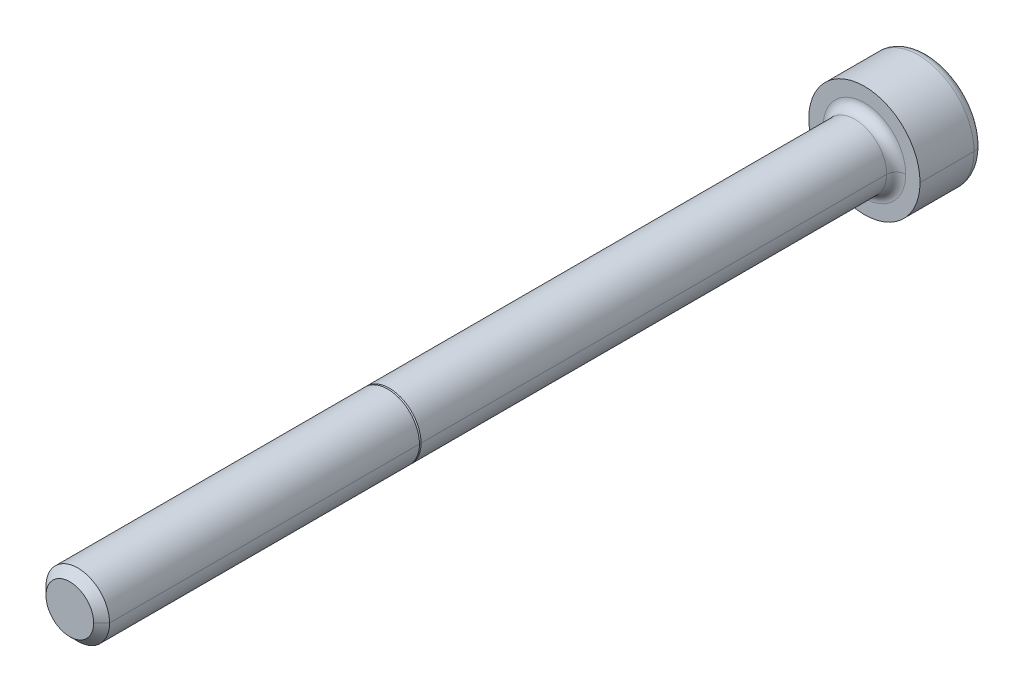
ISO-10303-21;
HEADER;
FILE_DESCRIPTION(('STEP AP214'),'2;1');
FILE_NAME('part.step','',(''),(''),'','','');
FILE_SCHEMA(('AUTOMOTIVE_DESIGN { 1 0 10303 214 1 1 1 1 }'));
ENDSEC;
DATA;
#1=APPLICATION_CONTEXT('core data for automotive mechanical design processes');
#2=APPLICATION_PROTOCOL_DEFINITION('international standard','automotive_design',2000,#1);
#3=PRODUCT_CONTEXT('',#1,'mechanical');
#4=PRODUCT('Part','Part','',(#3));
#5=PRODUCT_RELATED_PRODUCT_CATEGORY('part','',(#4));
#6=PRODUCT_DEFINITION_FORMATION('','',#4);
#7=PRODUCT_DEFINITION_CONTEXT('part definition',#1,'design');
#8=PRODUCT_DEFINITION('design','',#6,#7);
#9=PRODUCT_DEFINITION_SHAPE('','',#8);
#10=(LENGTH_UNIT() NAMED_UNIT(*) SI_UNIT(.MILLI.,.METRE.));
#11=(NAMED_UNIT(*) PLANE_ANGLE_UNIT() SI_UNIT($,.RADIAN.));
#12=(NAMED_UNIT(*) SI_UNIT($,.STERADIAN.) SOLID_ANGLE_UNIT());
#13=UNCERTAINTY_MEASURE_WITH_UNIT(LENGTH_MEASURE(1.E-05),#10,'distance_accuracy_value','');
#14=(GEOMETRIC_REPRESENTATION_CONTEXT(3) GLOBAL_UNCERTAINTY_ASSIGNED_CONTEXT((#13)) GLOBAL_UNIT_ASSIGNED_CONTEXT((#10,
#11,#12)) REPRESENTATION_CONTEXT('',''));
#15=CARTESIAN_POINT('',(0.,0.,0.));
#16=DIRECTION('',(0.,0.,1.));
#17=DIRECTION('',(1.,0.,0.));
#18=AXIS2_PLACEMENT_3D('',#15,#16,#17);
#19=CARTESIAN_POINT('',(0.,0.,-3.4));
#20=DIRECTION('',(0.,0.,1.));
#21=DIRECTION('',(1.,0.,0.));
#22=AXIS2_PLACEMENT_3D('',#19,#20,#21);
#23=TOROIDAL_SURFACE('',#22,2.9,0.6);
#24=CARTESIAN_POINT('',(-2.9,0.,-3.4));
#25=DIRECTION('',(0.,1.,0.));
#26=DIRECTION('',(-1.,0.,0.));
#27=AXIS2_PLACEMENT_3D('',#24,#25,#26);
#28=CIRCLE('',#27,0.6);
#29=CARTESIAN_POINT('',(-2.9,0.,-4.));
#30=VERTEX_POINT('',#29);
#31=CARTESIAN_POINT('',(-3.5,0.,-3.4));
#32=VERTEX_POINT('',#31);
#33=EDGE_CURVE('E183',#30,#32,#28,.T.);
#34=ORIENTED_EDGE('',*,*,#33,.F.);
#35=CARTESIAN_POINT('',(0.,0.,-4.));
#36=DIRECTION('',(0.,0.,-1.));
#37=DIRECTION('',(1.,0.,0.));
#38=AXIS2_PLACEMENT_3D('',#35,#36,#37);
#39=CIRCLE('',#38,2.9);
#40=CARTESIAN_POINT('',(2.9,0.,-4.));
#41=VERTEX_POINT('',#40);
#42=EDGE_CURVE('E170',#41,#30,#39,.T.);
#43=ORIENTED_EDGE('',*,*,#42,.F.);
#44=CARTESIAN_POINT('',(2.9,0.,-3.4));
#45=DIRECTION('',(0.,-1.,0.));
#46=DIRECTION('',(0.,0.,-1.));
#47=AXIS2_PLACEMENT_3D('',#44,#45,#46);
#48=CIRCLE('',#47,0.6);
#49=CARTESIAN_POINT('',(3.5,0.,-3.4));
#50=VERTEX_POINT('',#49);
#51=EDGE_CURVE('E192',#41,#50,#48,.T.);
#52=ORIENTED_EDGE('',*,*,#51,.T.);
#53=CARTESIAN_POINT('',(0.,0.,-3.4));
#54=DIRECTION('',(0.,0.,1.));
#55=DIRECTION('',(1.,0.,0.));
#56=AXIS2_PLACEMENT_3D('',#53,#54,#55);
#57=CIRCLE('',#56,3.5);
#58=EDGE_CURVE('E184',#32,#50,#57,.T.);
#59=ORIENTED_EDGE('',*,*,#58,.F.);
#60=EDGE_LOOP('',(#34,#43,#52,#59));
#61=FACE_BOUND('',#60,.T.);
#62=ADVANCED_FACE('F17',(#61),#23,.T.);
#63=CARTESIAN_POINT('',(0.,0.,0.6));
#64=DIRECTION('',(0.,0.,1.));
#65=DIRECTION('',(1.,0.,0.));
#66=AXIS2_PLACEMENT_3D('',#63,#64,#65);
#67=TOROIDAL_SURFACE('',#66,2.6,0.6);
#68=CARTESIAN_POINT('',(-2.6,0.,0.6));
#69=DIRECTION('',(0.,1.,0.));
#70=DIRECTION('',(-1.,0.,0.));
#71=AXIS2_PLACEMENT_3D('',#68,#69,#70);
#72=CIRCLE('',#71,0.6);
#73=CARTESIAN_POINT('',(-2.,0.,0.6));
#74=VERTEX_POINT('',#73);
#75=CARTESIAN_POINT('',(-2.6,0.,0.));
#76=VERTEX_POINT('',#75);
#77=EDGE_CURVE('E232',#74,#76,#72,.T.);
#78=ORIENTED_EDGE('',*,*,#77,.F.);
#79=CARTESIAN_POINT('',(0.,0.,0.6));
#80=DIRECTION('',(0.,0.,1.));
#81=DIRECTION('',(1.,0.,0.));
#82=AXIS2_PLACEMENT_3D('',#79,#80,#81);
#83=CIRCLE('',#82,2.);
#84=CARTESIAN_POINT('',(2.,0.,0.6));
#85=VERTEX_POINT('',#84);
#86=EDGE_CURVE('E281',#85,#74,#83,.T.);
#87=ORIENTED_EDGE('',*,*,#86,.F.);
#88=CARTESIAN_POINT('',(2.6,0.,0.6));
#89=DIRECTION('',(0.,-1.,0.));
#90=DIRECTION('',(0.,0.,-1.));
#91=AXIS2_PLACEMENT_3D('',#88,#89,#90);
#92=CIRCLE('',#91,0.6);
#93=CARTESIAN_POINT('',(2.6,0.,0.));
#94=VERTEX_POINT('',#93);
#95=EDGE_CURVE('E253',#85,#94,#92,.T.);
#96=ORIENTED_EDGE('',*,*,#95,.T.);
#97=CARTESIAN_POINT('',(0.,0.,0.));
#98=DIRECTION('',(0.,0.,-1.));
#99=DIRECTION('',(1.,0.,0.));
#100=AXIS2_PLACEMENT_3D('',#97,#98,#99);
#101=CIRCLE('',#100,2.6);
#102=EDGE_CURVE('E321',#76,#94,#101,.T.);
#103=ORIENTED_EDGE('',*,*,#102,.F.);
#104=EDGE_LOOP('',(#78,#87,#96,#103));
#105=FACE_BOUND('',#104,.T.);
#106=ADVANCED_FACE('F393',(#105),#67,.F.);
#107=CARTESIAN_POINT('',(0.,0.,50.));
#108=DIRECTION('',(0.,0.,-1.));
#109=DIRECTION('',(-1.,0.,0.));
#110=AXIS2_PLACEMENT_3D('',#107,#108,#109);
#111=CONICAL_SURFACE('',#110,1.5,0.785398163397446);
#112=DIRECTION('',(0.707106781186546,0.,-0.707106781186549));
#113=VECTOR('',#112,1.);
#114=CARTESIAN_POINT('',(1.5,0.,50.));
#115=LINE('',#114,#113);
#116=CARTESIAN_POINT('',(1.5,0.,50.));
#117=VERTEX_POINT('',#116);
#118=CARTESIAN_POINT('',(2.,0.,49.5));
#119=VERTEX_POINT('',#118);
#120=EDGE_CURVE('E228',#117,#119,#115,.T.);
#121=ORIENTED_EDGE('',*,*,#120,.F.);
#122=CARTESIAN_POINT('',(0.,0.,50.));
#123=DIRECTION('',(0.,0.,1.));
#124=DIRECTION('',(1.,0.,0.));
#125=AXIS2_PLACEMENT_3D('',#122,#123,#124);
#126=CIRCLE('',#125,1.5);
#127=CARTESIAN_POINT('',(-1.5,0.,50.));
#128=VERTEX_POINT('',#127);
#129=EDGE_CURVE('E11',#128,#117,#126,.T.);
#130=ORIENTED_EDGE('',*,*,#129,.F.);
#131=DIRECTION('',(-0.707106781186546,0.,-0.707106781186549));
#132=VECTOR('',#131,1.);
#133=CARTESIAN_POINT('',(-1.5,0.,50.));
#134=LINE('',#133,#132);
#135=CARTESIAN_POINT('',(-2.,0.,49.5));
#136=VERTEX_POINT('',#135);
#137=EDGE_CURVE('E227',#128,#136,#134,.T.);
#138=ORIENTED_EDGE('',*,*,#137,.T.);
#139=CARTESIAN_POINT('',(0.,0.,49.5));
#140=DIRECTION('',(0.,0.,-1.));
#141=DIRECTION('',(1.,0.,0.));
#142=AXIS2_PLACEMENT_3D('',#139,#140,#141);
#143=CIRCLE('',#142,2.);
#144=EDGE_CURVE('E354',#119,#136,#143,.T.);
#145=ORIENTED_EDGE('',*,*,#144,.F.);
#146=EDGE_LOOP('',(#121,#130,#138,#145));
#147=FACE_BOUND('',#146,.T.);
#148=ADVANCED_FACE('F19',(#147),#111,.T.);
#149=CARTESIAN_POINT('',(0.,0.,30.));
#150=DIRECTION('',(0.,0.,1.));
#151=DIRECTION('',(1.,0.,0.));
#152=AXIS2_PLACEMENT_3D('',#149,#150,#151);
#153=PLANE('',#152);
#154=CARTESIAN_POINT('',(0.,0.,30.));
#155=DIRECTION('',(0.,0.,1.));
#156=DIRECTION('',(1.,0.,0.));
#157=AXIS2_PLACEMENT_3D('',#154,#155,#156);
#158=CIRCLE('',#157,1.9);
#159=CARTESIAN_POINT('',(-1.9,0.,30.));
#160=VERTEX_POINT('',#159);
#161=CARTESIAN_POINT('',(1.9,0.,30.));
#162=VERTEX_POINT('',#161);
#163=EDGE_CURVE('E352',#160,#162,#158,.T.);
#164=ORIENTED_EDGE('',*,*,#163,.T.);
#165=CARTESIAN_POINT('',(0.,0.,30.));
#166=DIRECTION('',(0.,0.,1.));
#167=DIRECTION('',(1.,0.,0.));
#168=AXIS2_PLACEMENT_3D('',#165,#166,#167);
#169=CIRCLE('',#168,1.9);
#170=EDGE_CURVE('E238',#162,#160,#169,.T.);
#171=ORIENTED_EDGE('',*,*,#170,.T.);
#172=EDGE_LOOP('',(#164,#171));
#173=FACE_BOUND('',#172,.T.);
#174=CARTESIAN_POINT('',(0.,0.,30.));
#175=DIRECTION('',(0.,0.,1.));
#176=DIRECTION('',(1.,0.,0.));
#177=AXIS2_PLACEMENT_3D('',#174,#175,#176);
#178=CIRCLE('',#177,2.);
#179=CARTESIAN_POINT('',(-2.,0.,30.));
#180=VERTEX_POINT('',#179);
#181=CARTESIAN_POINT('',(2.,0.,30.));
#182=VERTEX_POINT('',#181);
#183=EDGE_CURVE('E21',#180,#182,#178,.T.);
#184=ORIENTED_EDGE('',*,*,#183,.F.);
#185=CARTESIAN_POINT('',(0.,0.,30.));
#186=DIRECTION('',(0.,0.,1.));
#187=DIRECTION('',(1.,0.,0.));
#188=AXIS2_PLACEMENT_3D('',#185,#186,#187);
#189=CIRCLE('',#188,2.);
#190=EDGE_CURVE('E201',#182,#180,#189,.T.);
#191=ORIENTED_EDGE('',*,*,#190,.F.);
#192=EDGE_LOOP('',(#184,#191));
#193=FACE_BOUND('',#192,.T.);
#194=ADVANCED_FACE('F368',(#173,#193),#153,.F.);
#195=CARTESIAN_POINT('',(0.,0.,50.));
#196=DIRECTION('',(0.,0.,1.));
#197=DIRECTION('',(1.,0.,0.));
#198=AXIS2_PLACEMENT_3D('',#195,#196,#197);
#199=PLANE('',#198);
#200=ORIENTED_EDGE('',*,*,#129,.T.);
#201=CARTESIAN_POINT('',(0.,0.,50.));
#202=DIRECTION('',(0.,0.,1.));
#203=DIRECTION('',(1.,0.,0.));
#204=AXIS2_PLACEMENT_3D('',#201,#202,#203);
#205=CIRCLE('',#204,1.5);
#206=EDGE_CURVE('E257',#117,#128,#205,.T.);
#207=ORIENTED_EDGE('',*,*,#206,.T.);
#208=EDGE_LOOP('',(#200,#207));
#209=FACE_BOUND('',#208,.T.);
#210=ADVANCED_FACE('F379',(#209),#199,.T.);
#211=CARTESIAN_POINT('',(0.,0.,50.));
#212=DIRECTION('',(0.,0.,-1.));
#213=DIRECTION('',(-1.,0.,0.));
#214=AXIS2_PLACEMENT_3D('',#211,#212,#213);
#215=CYLINDRICAL_SURFACE('',#214,2.);
#216=DIRECTION('',(0.,0.,-1.));
#217=VECTOR('',#216,1.);
#218=CARTESIAN_POINT('',(2.,0.,50.));
#219=LINE('',#218,#217);
#220=EDGE_CURVE('E204',#119,#182,#219,.T.);
#221=ORIENTED_EDGE('',*,*,#220,.F.);
#222=ORIENTED_EDGE('',*,*,#144,.T.);
#223=DIRECTION('',(0.,0.,-1.));
#224=VECTOR('',#223,1.);
#225=CARTESIAN_POINT('',(-2.,0.,50.));
#226=LINE('',#225,#224);
#227=EDGE_CURVE('E200',#136,#180,#226,.T.);
#228=ORIENTED_EDGE('',*,*,#227,.T.);
#229=ORIENTED_EDGE('',*,*,#183,.T.);
#230=EDGE_LOOP('',(#221,#222,#228,#229));
#231=FACE_BOUND('',#230,.T.);
#232=ADVANCED_FACE('F366',(#231),#215,.T.);
#233=CARTESIAN_POINT('',(0.,0.,30.));
#234=DIRECTION('',(0.,0.,-1.));
#235=DIRECTION('',(-1.,0.,0.));
#236=AXIS2_PLACEMENT_3D('',#233,#234,#235);
#237=CONICAL_SURFACE('',#236,1.9,0.78539816339744);
#238=DIRECTION('',(0.707106781186542,0.,-0.707106781186554));
#239=VECTOR('',#238,1.);
#240=CARTESIAN_POINT('',(1.9,0.,30.));
#241=LINE('',#240,#239);
#242=CARTESIAN_POINT('',(2.,0.,29.9));
#243=VERTEX_POINT('',#242);
#244=EDGE_CURVE('E233',#162,#243,#241,.T.);
#245=ORIENTED_EDGE('',*,*,#244,.F.);
#246=ORIENTED_EDGE('',*,*,#163,.F.);
#247=DIRECTION('',(-0.707106781186542,0.,-0.707106781186554));
#248=VECTOR('',#247,1.);
#249=CARTESIAN_POINT('',(-1.9,0.,30.));
#250=LINE('',#249,#248);
#251=CARTESIAN_POINT('',(-2.,0.,29.9));
#252=VERTEX_POINT('',#251);
#253=EDGE_CURVE('E273',#160,#252,#250,.T.);
#254=ORIENTED_EDGE('',*,*,#253,.T.);
#255=CARTESIAN_POINT('',(0.,0.,29.9));
#256=DIRECTION('',(0.,0.,-1.));
#257=DIRECTION('',(1.,0.,0.));
#258=AXIS2_PLACEMENT_3D('',#255,#256,#257);
#259=CIRCLE('',#258,2.);
#260=EDGE_CURVE('E349',#243,#252,#259,.T.);
#261=ORIENTED_EDGE('',*,*,#260,.F.);
#262=EDGE_LOOP('',(#245,#246,#254,#261));
#263=FACE_BOUND('',#262,.T.);
#264=ADVANCED_FACE('F387',(#263),#237,.T.);
#265=CARTESIAN_POINT('',(0.,0.,30.));
#266=DIRECTION('',(0.,0.,-1.));
#267=DIRECTION('',(-1.,0.,0.));
#268=AXIS2_PLACEMENT_3D('',#265,#266,#267);
#269=CYLINDRICAL_SURFACE('',#268,2.);
#270=DIRECTION('',(0.,0.,-1.));
#271=VECTOR('',#270,1.);
#272=CARTESIAN_POINT('',(2.,0.,30.));
#273=LINE('',#272,#271);
#274=EDGE_CURVE('E277',#243,#85,#273,.T.);
#275=ORIENTED_EDGE('',*,*,#274,.F.);
#276=ORIENTED_EDGE('',*,*,#260,.T.);
#277=DIRECTION('',(0.,0.,-1.));
#278=VECTOR('',#277,1.);
#279=CARTESIAN_POINT('',(-2.,0.,30.));
#280=LINE('',#279,#278);
#281=EDGE_CURVE('E285',#252,#74,#280,.T.);
#282=ORIENTED_EDGE('',*,*,#281,.T.);
#283=CARTESIAN_POINT('',(0.,0.,0.6));
#284=DIRECTION('',(0.,0.,1.));
#285=DIRECTION('',(1.,0.,0.));
#286=AXIS2_PLACEMENT_3D('',#283,#284,#285);
#287=CIRCLE('',#286,2.);
#288=EDGE_CURVE('E216',#74,#85,#287,.T.);
#289=ORIENTED_EDGE('',*,*,#288,.T.);
#290=EDGE_LOOP('',(#275,#276,#282,#289));
#291=FACE_BOUND('',#290,.T.);
#292=ADVANCED_FACE('F460',(#291),#269,.T.);
#293=CARTESIAN_POINT('',(0.,0.,-1.5));
#294=DIRECTION('',(0.,0.,-1.));
#295=DIRECTION('',(0.,-1.,0.));
#296=AXIS2_PLACEMENT_3D('',#293,#294,#295);
#297=PLANE('',#296);
#298=DIRECTION('',(-0.5,-0.866025403784439,0.));
#299=VECTOR('',#298,1.);
#300=CARTESIAN_POINT('',(1.73205080756888,0.,-1.5));
#301=LINE('',#300,#299);
#302=CARTESIAN_POINT('',(1.73205080756888,0.,-1.5));
#303=VERTEX_POINT('',#302);
#304=CARTESIAN_POINT('',(0.866025403784438,-1.5,-1.5));
#305=VERTEX_POINT('',#304);
#306=EDGE_CURVE('E325',#303,#305,#301,.T.);
#307=ORIENTED_EDGE('',*,*,#306,.T.);
#308=DIRECTION('',(-1.,0.,0.));
#309=VECTOR('',#308,1.);
#310=CARTESIAN_POINT('',(0.866025403784438,-1.5,-1.5));
#311=LINE('',#310,#309);
#312=CARTESIAN_POINT('',(-0.866025403784439,-1.5,-1.5));
#313=VERTEX_POINT('',#312);
#314=EDGE_CURVE('E40',#305,#313,#311,.T.);
#315=ORIENTED_EDGE('',*,*,#314,.T.);
#316=DIRECTION('',(-0.5,0.866025403784439,0.));
#317=VECTOR('',#316,1.);
#318=CARTESIAN_POINT('',(-0.866025403784439,-1.5,-1.5));
#319=LINE('',#318,#317);
#320=CARTESIAN_POINT('',(-1.73205080756888,0.,-1.5));
#321=VERTEX_POINT('',#320);
#322=EDGE_CURVE('E48',#313,#321,#319,.T.);
#323=ORIENTED_EDGE('',*,*,#322,.T.);
#324=DIRECTION('',(0.5,0.866025403784439,0.));
#325=VECTOR('',#324,1.);
#326=CARTESIAN_POINT('',(-1.73205080756888,0.,-1.5));
#327=LINE('',#326,#325);
#328=CARTESIAN_POINT('',(-0.866025403784439,1.5,-1.5));
#329=VERTEX_POINT('',#328);
#330=EDGE_CURVE('E340',#321,#329,#327,.T.);
#331=ORIENTED_EDGE('',*,*,#330,.T.);
#332=DIRECTION('',(1.,0.,0.));
#333=VECTOR('',#332,1.);
#334=CARTESIAN_POINT('',(-0.866025403784439,1.5,-1.5));
#335=LINE('',#334,#333);
#336=CARTESIAN_POINT('',(0.86602540378444,1.5,-1.5));
#337=VERTEX_POINT('',#336);
#338=EDGE_CURVE('E334',#329,#337,#335,.T.);
#339=ORIENTED_EDGE('',*,*,#338,.T.);
#340=DIRECTION('',(0.5,-0.866025403784439,0.));
#341=VECTOR('',#340,1.);
#342=CARTESIAN_POINT('',(0.86602540378444,1.5,-1.5));
#343=LINE('',#342,#341);
#344=EDGE_CURVE('E297',#337,#303,#343,.T.);
#345=ORIENTED_EDGE('',*,*,#344,.T.);
#346=EDGE_LOOP('',(#307,#315,#323,#331,#339,#345));
#347=FACE_BOUND('',#346,.T.);
#348=ADVANCED_FACE('F444',(#347),#297,.T.);
#349=CARTESIAN_POINT('',(0.866025403784438,-1.5,-1.5));
#350=DIRECTION('',(0.,-1.,0.));
#351=DIRECTION('',(-1.,0.,0.));
#352=AXIS2_PLACEMENT_3D('',#349,#350,#351);
#353=PLANE('',#352);
#354=DIRECTION('',(-1.,0.,0.));
#355=VECTOR('',#354,1.);
#356=CARTESIAN_POINT('',(0.866025403784438,-1.5,-4.));
#357=LINE('',#356,#355);
#358=CARTESIAN_POINT('',(0.866025403784438,-1.5,-4.));
#359=VERTEX_POINT('',#358);
#360=CARTESIAN_POINT('',(-0.866025403784439,-1.5,-4.));
#361=VERTEX_POINT('',#360);
#362=EDGE_CURVE('E179',#359,#361,#357,.T.);
#363=ORIENTED_EDGE('',*,*,#362,.T.);
#364=DIRECTION('',(0.,0.,-1.));
#365=VECTOR('',#364,1.);
#366=CARTESIAN_POINT('',(-0.866025403784439,-1.5,-1.5));
#367=LINE('',#366,#365);
#368=EDGE_CURVE('E248',#313,#361,#367,.T.);
#369=ORIENTED_EDGE('',*,*,#368,.F.);
#370=ORIENTED_EDGE('',*,*,#314,.F.);
#371=DIRECTION('',(0.,0.,-1.));
#372=VECTOR('',#371,1.);
#373=CARTESIAN_POINT('',(0.866025403784438,-1.5,-1.5));
#374=LINE('',#373,#372);
#375=EDGE_CURVE('E324',#305,#359,#374,.T.);
#376=ORIENTED_EDGE('',*,*,#375,.T.);
#377=EDGE_LOOP('',(#363,#369,#370,#376));
#378=FACE_BOUND('',#377,.T.);
#379=ADVANCED_FACE('F453',(#378),#353,.F.);
#380=CARTESIAN_POINT('',(-0.866025403784439,-1.5,-1.5));
#381=DIRECTION('',(-0.866025403784439,-0.5,0.));
#382=DIRECTION('',(-0.5,0.866025403784439,0.));
#383=AXIS2_PLACEMENT_3D('',#380,#381,#382);
#384=PLANE('',#383);
#385=DIRECTION('',(-0.5,0.866025403784439,0.));
#386=VECTOR('',#385,1.);
#387=CARTESIAN_POINT('',(-0.866025403784439,-1.5,-4.));
#388=LINE('',#387,#386);
#389=CARTESIAN_POINT('',(-1.73205080756888,0.,-4.));
#390=VERTEX_POINT('',#389);
#391=EDGE_CURVE('E317',#361,#390,#388,.T.);
#392=ORIENTED_EDGE('',*,*,#391,.T.);
#393=DIRECTION('',(0.,0.,-1.));
#394=VECTOR('',#393,1.);
#395=CARTESIAN_POINT('',(-1.73205080756888,0.,-1.5));
#396=LINE('',#395,#394);
#397=EDGE_CURVE('E249',#321,#390,#396,.T.);
#398=ORIENTED_EDGE('',*,*,#397,.F.);
#399=ORIENTED_EDGE('',*,*,#322,.F.);
#400=ORIENTED_EDGE('',*,*,#368,.T.);
#401=EDGE_LOOP('',(#392,#398,#399,#400));
#402=FACE_BOUND('',#401,.T.);
#403=ADVANCED_FACE('F451',(#402),#384,.F.);
#404=CARTESIAN_POINT('',(-1.73205080756888,0.,-1.5));
#405=DIRECTION('',(-0.866025403784439,0.5,0.));
#406=DIRECTION('',(0.,0.,1.));
#407=AXIS2_PLACEMENT_3D('',#404,#405,#406);
#408=PLANE('',#407);
#409=DIRECTION('',(0.5,0.866025403784439,0.));
#410=VECTOR('',#409,1.);
#411=CARTESIAN_POINT('',(-1.73205080756888,0.,-4.));
#412=LINE('',#411,#410);
#413=CARTESIAN_POINT('',(-0.866025403784439,1.5,-4.));
#414=VERTEX_POINT('',#413);
#415=EDGE_CURVE('E313',#390,#414,#412,.T.);
#416=ORIENTED_EDGE('',*,*,#415,.T.);
#417=DIRECTION('',(0.,0.,-1.));
#418=VECTOR('',#417,1.);
#419=CARTESIAN_POINT('',(-0.866025403784439,1.5,-1.5));
#420=LINE('',#419,#418);
#421=EDGE_CURVE('E337',#329,#414,#420,.T.);
#422=ORIENTED_EDGE('',*,*,#421,.F.);
#423=ORIENTED_EDGE('',*,*,#330,.F.);
#424=ORIENTED_EDGE('',*,*,#397,.T.);
#425=EDGE_LOOP('',(#416,#422,#423,#424));
#426=FACE_BOUND('',#425,.T.);
#427=ADVANCED_FACE('F430',(#426),#408,.F.);
#428=CARTESIAN_POINT('',(-0.866025403784439,1.5,-1.5));
#429=DIRECTION('',(0.,1.,0.));
#430=DIRECTION('',(1.,0.,0.));
#431=AXIS2_PLACEMENT_3D('',#428,#429,#430);
#432=PLANE('',#431);
#433=DIRECTION('',(1.,0.,0.));
#434=VECTOR('',#433,1.);
#435=CARTESIAN_POINT('',(-0.866025403784439,1.5,-4.));
#436=LINE('',#435,#434);
#437=CARTESIAN_POINT('',(0.86602540378444,1.5,-4.));
#438=VERTEX_POINT('',#437);
#439=EDGE_CURVE('E221',#414,#438,#436,.T.);
#440=ORIENTED_EDGE('',*,*,#439,.T.);
#441=DIRECTION('',(0.,0.,-1.));
#442=VECTOR('',#441,1.);
#443=CARTESIAN_POINT('',(0.86602540378444,1.5,-1.5));
#444=LINE('',#443,#442);
#445=EDGE_CURVE('E300',#337,#438,#444,.T.);
#446=ORIENTED_EDGE('',*,*,#445,.F.);
#447=ORIENTED_EDGE('',*,*,#338,.F.);
#448=ORIENTED_EDGE('',*,*,#421,.T.);
#449=EDGE_LOOP('',(#440,#446,#447,#448));
#450=FACE_BOUND('',#449,.T.);
#451=ADVANCED_FACE('F425',(#450),#432,.F.);
#452=CARTESIAN_POINT('',(0.86602540378444,1.5,-1.5));
#453=DIRECTION('',(0.866025403784439,0.5,0.));
#454=DIRECTION('',(0.,0.,-1.));
#455=AXIS2_PLACEMENT_3D('',#452,#453,#454);
#456=PLANE('',#455);
#457=DIRECTION('',(0.5,-0.866025403784439,0.));
#458=VECTOR('',#457,1.);
#459=CARTESIAN_POINT('',(0.86602540378444,1.5,-4.));
#460=LINE('',#459,#458);
#461=CARTESIAN_POINT('',(1.73205080756888,0.,-4.));
#462=VERTEX_POINT('',#461);
#463=EDGE_CURVE('E217',#438,#462,#460,.T.);
#464=ORIENTED_EDGE('',*,*,#463,.T.);
#465=DIRECTION('',(0.,0.,-1.));
#466=VECTOR('',#465,1.);
#467=CARTESIAN_POINT('',(1.73205080756888,0.,-1.5));
#468=LINE('',#467,#466);
#469=EDGE_CURVE('E301',#303,#462,#468,.T.);
#470=ORIENTED_EDGE('',*,*,#469,.F.);
#471=ORIENTED_EDGE('',*,*,#344,.F.);
#472=ORIENTED_EDGE('',*,*,#445,.T.);
#473=EDGE_LOOP('',(#464,#470,#471,#472));
#474=FACE_BOUND('',#473,.T.);
#475=ADVANCED_FACE('F422',(#474),#456,.F.);
#476=CARTESIAN_POINT('',(1.73205080756888,0.,-1.5));
#477=DIRECTION('',(0.866025403784439,-0.5,0.));
#478=DIRECTION('',(0.,0.,-1.));
#479=AXIS2_PLACEMENT_3D('',#476,#477,#478);
#480=PLANE('',#479);
#481=DIRECTION('',(-0.5,-0.866025403784439,0.));
#482=VECTOR('',#481,1.);
#483=CARTESIAN_POINT('',(1.73205080756888,0.,-4.));
#484=LINE('',#483,#482);
#485=EDGE_CURVE('E222',#462,#359,#484,.T.);
#486=ORIENTED_EDGE('',*,*,#485,.T.);
#487=ORIENTED_EDGE('',*,*,#375,.F.);
#488=ORIENTED_EDGE('',*,*,#306,.F.);
#489=ORIENTED_EDGE('',*,*,#469,.T.);
#490=EDGE_LOOP('',(#486,#487,#488,#489));
#491=FACE_BOUND('',#490,.T.);
#492=ADVANCED_FACE('F411',(#491),#480,.F.);
#493=CARTESIAN_POINT('',(0.,0.,0.));
#494=DIRECTION('',(0.,0.,1.));
#495=DIRECTION('',(1.,0.,0.));
#496=AXIS2_PLACEMENT_3D('',#493,#494,#495);
#497=PLANE('',#496);
#498=CARTESIAN_POINT('',(0.,0.,0.));
#499=DIRECTION('',(0.,0.,-1.));
#500=DIRECTION('',(1.,0.,0.));
#501=AXIS2_PLACEMENT_3D('',#498,#499,#500);
#502=CIRCLE('',#501,2.6);
#503=EDGE_CURVE('E242',#94,#76,#502,.T.);
#504=ORIENTED_EDGE('',*,*,#503,.T.);
#505=ORIENTED_EDGE('',*,*,#102,.T.);
#506=EDGE_LOOP('',(#504,#505));
#507=FACE_BOUND('',#506,.T.);
#508=CARTESIAN_POINT('',(0.,0.,0.));
#509=DIRECTION('',(0.,0.,1.));
#510=DIRECTION('',(1.,0.,0.));
#511=AXIS2_PLACEMENT_3D('',#508,#509,#510);
#512=CIRCLE('',#511,3.5);
#513=CARTESIAN_POINT('',(3.5,0.,0.));
#514=VERTEX_POINT('',#513);
#515=CARTESIAN_POINT('',(-3.5,0.,0.));
#516=VERTEX_POINT('',#515);
#517=EDGE_CURVE('E210',#514,#516,#512,.T.);
#518=ORIENTED_EDGE('',*,*,#517,.T.);
#519=CARTESIAN_POINT('',(0.,0.,0.));
#520=DIRECTION('',(0.,0.,1.));
#521=DIRECTION('',(1.,0.,0.));
#522=AXIS2_PLACEMENT_3D('',#519,#520,#521);
#523=CIRCLE('',#522,3.5);
#524=EDGE_CURVE('E180',#516,#514,#523,.T.);
#525=ORIENTED_EDGE('',*,*,#524,.T.);
#526=EDGE_LOOP('',(#518,#525));
#527=FACE_BOUND('',#526,.T.);
#528=ADVANCED_FACE('F408',(#507,#527),#497,.T.);
#529=CARTESIAN_POINT('',(0.,0.,-4.));
#530=DIRECTION('',(0.,0.,1.));
#531=DIRECTION('',(1.,0.,0.));
#532=AXIS2_PLACEMENT_3D('',#529,#530,#531);
#533=PLANE('',#532);
#534=ORIENTED_EDGE('',*,*,#362,.F.);
#535=ORIENTED_EDGE('',*,*,#485,.F.);
#536=ORIENTED_EDGE('',*,*,#463,.F.);
#537=ORIENTED_EDGE('',*,*,#439,.F.);
#538=ORIENTED_EDGE('',*,*,#415,.F.);
#539=ORIENTED_EDGE('',*,*,#391,.F.);
#540=EDGE_LOOP('',(#534,#535,#536,#537,#538,#539));
#541=FACE_BOUND('',#540,.T.);
#542=ORIENTED_EDGE('',*,*,#42,.T.);
#543=CARTESIAN_POINT('',(0.,0.,-4.));
#544=DIRECTION('',(0.,0.,-1.));
#545=DIRECTION('',(1.,0.,0.));
#546=AXIS2_PLACEMENT_3D('',#543,#544,#545);
#547=CIRCLE('',#546,2.9);
#548=EDGE_CURVE('E174',#30,#41,#547,.T.);
#549=ORIENTED_EDGE('',*,*,#548,.T.);
#550=EDGE_LOOP('',(#542,#549));
#551=FACE_BOUND('',#550,.T.);
#552=ADVANCED_FACE('F172',(#541,#551),#533,.F.);
#553=CARTESIAN_POINT('',(0.,0.,-4.));
#554=DIRECTION('',(0.,0.,1.));
#555=DIRECTION('',(1.,0.,0.));
#556=AXIS2_PLACEMENT_3D('',#553,#554,#555);
#557=CYLINDRICAL_SURFACE('',#556,3.5);
#558=DIRECTION('',(0.,0.,1.));
#559=VECTOR('',#558,1.);
#560=CARTESIAN_POINT('',(-3.5,0.,-4.));
#561=LINE('',#560,#559);
#562=EDGE_CURVE('E288',#32,#516,#561,.T.);
#563=ORIENTED_EDGE('',*,*,#562,.F.);
#564=ORIENTED_EDGE('',*,*,#58,.T.);
#565=DIRECTION('',(0.,0.,1.));
#566=VECTOR('',#565,1.);
#567=CARTESIAN_POINT('',(3.5,0.,-4.));
#568=LINE('',#567,#566);
#569=EDGE_CURVE('E206',#50,#514,#568,.T.);
#570=ORIENTED_EDGE('',*,*,#569,.T.);
#571=ORIENTED_EDGE('',*,*,#524,.F.);
#572=EDGE_LOOP('',(#563,#564,#570,#571));
#573=FACE_BOUND('',#572,.T.);
#574=ADVANCED_FACE('F416',(#573),#557,.T.);
#575=CARTESIAN_POINT('',(0.,0.,-4.));
#576=DIRECTION('',(0.,0.,1.));
#577=DIRECTION('',(1.,0.,0.));
#578=AXIS2_PLACEMENT_3D('',#575,#576,#577);
#579=CYLINDRICAL_SURFACE('',#578,3.5);
#580=CARTESIAN_POINT('',(0.,0.,-3.4));
#581=DIRECTION('',(0.,0.,1.));
#582=DIRECTION('',(1.,0.,0.));
#583=AXIS2_PLACEMENT_3D('',#580,#581,#582);
#584=CIRCLE('',#583,3.5);
#585=EDGE_CURVE('E189',#50,#32,#584,.T.);
#586=ORIENTED_EDGE('',*,*,#585,.T.);
#587=ORIENTED_EDGE('',*,*,#562,.T.);
#588=ORIENTED_EDGE('',*,*,#517,.F.);
#589=ORIENTED_EDGE('',*,*,#569,.F.);
#590=EDGE_LOOP('',(#586,#587,#588,#589));
#591=FACE_BOUND('',#590,.T.);
#592=ADVANCED_FACE('F413',(#591),#579,.T.);
#593=CARTESIAN_POINT('',(0.,0.,30.));
#594=DIRECTION('',(0.,0.,-1.));
#595=DIRECTION('',(-1.,0.,0.));
#596=AXIS2_PLACEMENT_3D('',#593,#594,#595);
#597=CYLINDRICAL_SURFACE('',#596,2.);
#598=CARTESIAN_POINT('',(0.,0.,29.9));
#599=DIRECTION('',(0.,0.,-1.));
#600=DIRECTION('',(1.,0.,0.));
#601=AXIS2_PLACEMENT_3D('',#598,#599,#600);
#602=CIRCLE('',#601,2.);
#603=EDGE_CURVE('E237',#252,#243,#602,.T.);
#604=ORIENTED_EDGE('',*,*,#603,.T.);
#605=ORIENTED_EDGE('',*,*,#274,.T.);
#606=ORIENTED_EDGE('',*,*,#86,.T.);
#607=ORIENTED_EDGE('',*,*,#281,.F.);
#608=EDGE_LOOP('',(#604,#605,#606,#607));
#609=FACE_BOUND('',#608,.T.);
#610=ADVANCED_FACE('F406',(#609),#597,.T.);
#611=CARTESIAN_POINT('',(0.,0.,30.));
#612=DIRECTION('',(0.,0.,-1.));
#613=DIRECTION('',(-1.,0.,0.));
#614=AXIS2_PLACEMENT_3D('',#611,#612,#613);
#615=CONICAL_SURFACE('',#614,1.9,0.78539816339744);
#616=ORIENTED_EDGE('',*,*,#170,.F.);
#617=ORIENTED_EDGE('',*,*,#244,.T.);
#618=ORIENTED_EDGE('',*,*,#603,.F.);
#619=ORIENTED_EDGE('',*,*,#253,.F.);
#620=EDGE_LOOP('',(#616,#617,#618,#619));
#621=FACE_BOUND('',#620,.T.);
#622=ADVANCED_FACE('F403',(#621),#615,.T.);
#623=CARTESIAN_POINT('',(0.,0.,50.));
#624=DIRECTION('',(0.,0.,-1.));
#625=DIRECTION('',(-1.,0.,0.));
#626=AXIS2_PLACEMENT_3D('',#623,#624,#625);
#627=CYLINDRICAL_SURFACE('',#626,2.);
#628=CARTESIAN_POINT('',(0.,0.,49.5));
#629=DIRECTION('',(0.,0.,-1.));
#630=DIRECTION('',(1.,0.,0.));
#631=AXIS2_PLACEMENT_3D('',#628,#629,#630);
#632=CIRCLE('',#631,2.);
#633=EDGE_CURVE('E223',#136,#119,#632,.T.);
#634=ORIENTED_EDGE('',*,*,#633,.T.);
#635=ORIENTED_EDGE('',*,*,#220,.T.);
#636=ORIENTED_EDGE('',*,*,#190,.T.);
#637=ORIENTED_EDGE('',*,*,#227,.F.);
#638=EDGE_LOOP('',(#634,#635,#636,#637));
#639=FACE_BOUND('',#638,.T.);
#640=ADVANCED_FACE('F370',(#639),#627,.T.);
#641=CARTESIAN_POINT('',(0.,0.,50.));
#642=DIRECTION('',(0.,0.,-1.));
#643=DIRECTION('',(-1.,0.,0.));
#644=AXIS2_PLACEMENT_3D('',#641,#642,#643);
#645=CONICAL_SURFACE('',#644,1.5,0.785398163397446);
#646=ORIENTED_EDGE('',*,*,#206,.F.);
#647=ORIENTED_EDGE('',*,*,#120,.T.);
#648=ORIENTED_EDGE('',*,*,#633,.F.);
#649=ORIENTED_EDGE('',*,*,#137,.F.);
#650=EDGE_LOOP('',(#646,#647,#648,#649));
#651=FACE_BOUND('',#650,.T.);
#652=ADVANCED_FACE('F376',(#651),#645,.T.);
#653=CARTESIAN_POINT('',(0.,0.,0.6));
#654=DIRECTION('',(0.,0.,1.));
#655=DIRECTION('',(1.,0.,0.));
#656=AXIS2_PLACEMENT_3D('',#653,#654,#655);
#657=TOROIDAL_SURFACE('',#656,2.6,0.6);
#658=ORIENTED_EDGE('',*,*,#288,.F.);
#659=ORIENTED_EDGE('',*,*,#77,.T.);
#660=ORIENTED_EDGE('',*,*,#503,.F.);
#661=ORIENTED_EDGE('',*,*,#95,.F.);
#662=EDGE_LOOP('',(#658,#659,#660,#661));
#663=FACE_BOUND('',#662,.T.);
#664=ADVANCED_FACE('F481',(#663),#657,.F.);
#665=CARTESIAN_POINT('',(0.,0.,-3.4));
#666=DIRECTION('',(0.,0.,1.));
#667=DIRECTION('',(1.,0.,0.));
#668=AXIS2_PLACEMENT_3D('',#665,#666,#667);
#669=TOROIDAL_SURFACE('',#668,2.9,0.6);
#670=ORIENTED_EDGE('',*,*,#548,.F.);
#671=ORIENTED_EDGE('',*,*,#33,.T.);
#672=ORIENTED_EDGE('',*,*,#585,.F.);
#673=ORIENTED_EDGE('',*,*,#51,.F.);
#674=EDGE_LOOP('',(#670,#671,#672,#673));
#675=FACE_BOUND('',#674,.T.);
#676=ADVANCED_FACE('F191',(#675),#669,.T.);
#677=CLOSED_SHELL('',(#62,#106,#148,#194,#210,#232,#264,#292,#348,#379,#403,#427,#451,#475,#492,
#528,#552,#574,#592,#610,#622,#640,#652,#664,#676));
#678=MANIFOLD_SOLID_BREP('B1',#677);
#679=ADVANCED_BREP_SHAPE_REPRESENTATION('',(#18,#678),#14);
#680=SHAPE_DEFINITION_REPRESENTATION(#9,#679);
ENDSEC;
END-ISO-10303-21;
